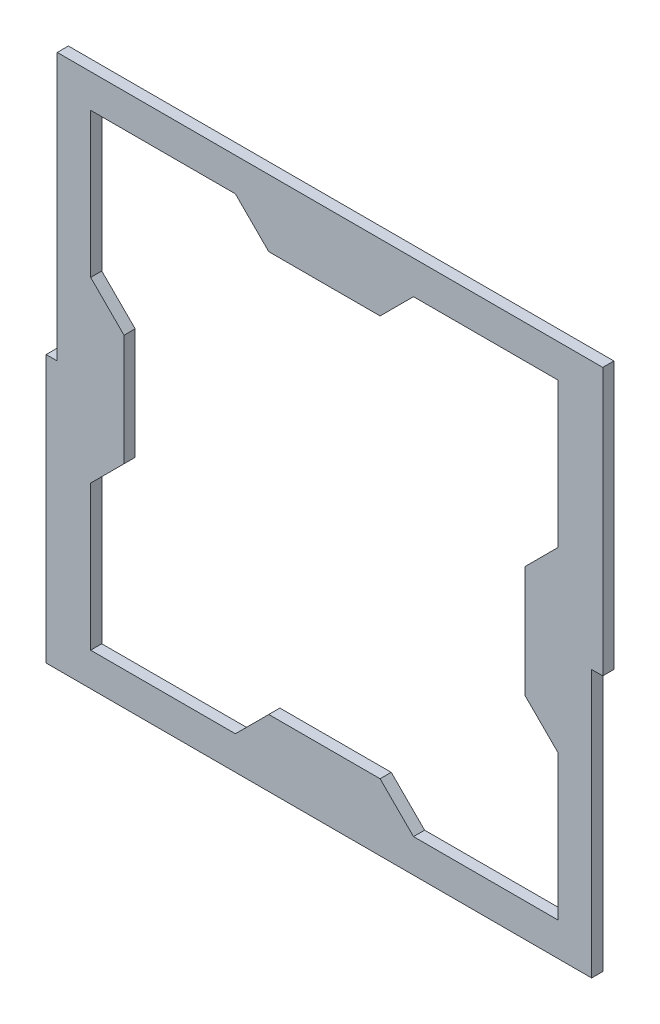
ISO-10303-21;
HEADER;
FILE_DESCRIPTION(('STEP AP214'),'2;1');
FILE_NAME('part.step','',(''),(''),'','','');
FILE_SCHEMA(('AUTOMOTIVE_DESIGN { 1 0 10303 214 1 1 1 1 }'));
ENDSEC;
DATA;
#1=APPLICATION_CONTEXT('core data for automotive mechanical design processes');
#2=APPLICATION_PROTOCOL_DEFINITION('international standard','automotive_design',2000,#1);
#3=PRODUCT_CONTEXT('',#1,'mechanical');
#4=PRODUCT('Part','Part','',(#3));
#5=PRODUCT_RELATED_PRODUCT_CATEGORY('part','',(#4));
#6=PRODUCT_DEFINITION_FORMATION('','',#4);
#7=PRODUCT_DEFINITION_CONTEXT('part definition',#1,'design');
#8=PRODUCT_DEFINITION('design','',#6,#7);
#9=PRODUCT_DEFINITION_SHAPE('','',#8);
#10=(LENGTH_UNIT() NAMED_UNIT(*) SI_UNIT(.MILLI.,.METRE.));
#11=(NAMED_UNIT(*) PLANE_ANGLE_UNIT() SI_UNIT($,.RADIAN.));
#12=(NAMED_UNIT(*) SI_UNIT($,.STERADIAN.) SOLID_ANGLE_UNIT());
#13=UNCERTAINTY_MEASURE_WITH_UNIT(LENGTH_MEASURE(1.E-05),#10,'distance_accuracy_value','');
#14=(GEOMETRIC_REPRESENTATION_CONTEXT(3) GLOBAL_UNCERTAINTY_ASSIGNED_CONTEXT((#13)) GLOBAL_UNIT_ASSIGNED_CONTEXT((#10,
#11,#12)) REPRESENTATION_CONTEXT('',''));
#15=CARTESIAN_POINT('',(0.,0.,0.));
#16=DIRECTION('',(0.,0.,1.));
#17=DIRECTION('',(1.,0.,0.));
#18=AXIS2_PLACEMENT_3D('',#15,#16,#17);
#19=CARTESIAN_POINT('',(-76.2,0.,3.175));
#20=DIRECTION('',(-1.,0.,0.));
#21=DIRECTION('',(0.,0.,1.));
#22=AXIS2_PLACEMENT_3D('',#19,#20,#21);
#23=PLANE('',#22);
#24=DIRECTION('',(0.,1.,0.));
#25=VECTOR('',#24,1.);
#26=CARTESIAN_POINT('',(-76.2,0.,0.));
#27=LINE('',#26,#25);
#28=CARTESIAN_POINT('',(-76.2,0.,0.));
#29=VERTEX_POINT('',#28);
#30=CARTESIAN_POINT('',(-76.2,76.2,0.));
#31=VERTEX_POINT('',#30);
#32=EDGE_CURVE('E273',#29,#31,#27,.T.);
#33=ORIENTED_EDGE('',*,*,#32,.F.);
#34=DIRECTION('',(0.,0.,1.));
#35=VECTOR('',#34,1.);
#36=CARTESIAN_POINT('',(-76.2,0.,0.));
#37=LINE('',#36,#35);
#38=CARTESIAN_POINT('',(-76.2,0.,3.175));
#39=VERTEX_POINT('',#38);
#40=EDGE_CURVE('E249',#29,#39,#37,.T.);
#41=ORIENTED_EDGE('',*,*,#40,.T.);
#42=DIRECTION('',(0.,1.,0.));
#43=VECTOR('',#42,1.);
#44=CARTESIAN_POINT('',(-76.2,0.,3.175));
#45=LINE('',#44,#43);
#46=CARTESIAN_POINT('',(-76.2,76.2,3.175));
#47=VERTEX_POINT('',#46);
#48=EDGE_CURVE('E290',#39,#47,#45,.T.);
#49=ORIENTED_EDGE('',*,*,#48,.T.);
#50=DIRECTION('',(0.,0.,-1.));
#51=VECTOR('',#50,1.);
#52=CARTESIAN_POINT('',(-76.2,76.2,3.175));
#53=LINE('',#52,#51);
#54=EDGE_CURVE('E279',#47,#31,#53,.T.);
#55=ORIENTED_EDGE('',*,*,#54,.T.);
#56=EDGE_LOOP('',(#33,#41,#49,#55));
#57=FACE_BOUND('',#56,.T.);
#58=ADVANCED_FACE('F33',(#57),#23,.T.);
#59=CARTESIAN_POINT('',(0.,-66.675,3.175));
#60=DIRECTION('',(0.,-1.,0.));
#61=DIRECTION('',(0.,0.,-1.));
#62=AXIS2_PLACEMENT_3D('',#59,#60,#61);
#63=PLANE('',#62);
#64=DIRECTION('',(-1.,0.,0.));
#65=VECTOR('',#64,1.);
#66=CARTESIAN_POINT('',(0.,-66.675,0.));
#67=LINE('',#66,#65);
#68=CARTESIAN_POINT('',(66.675,-66.675,0.));
#69=VERTEX_POINT('',#68);
#70=CARTESIAN_POINT('',(25.3999999999994,-66.675,0.));
#71=VERTEX_POINT('',#70);
#72=EDGE_CURVE('E298',#69,#71,#67,.T.);
#73=ORIENTED_EDGE('',*,*,#72,.T.);
#74=DIRECTION('',(0.,0.,-1.));
#75=VECTOR('',#74,1.);
#76=CARTESIAN_POINT('',(25.3999999999994,-66.675,3.175));
#77=LINE('',#76,#75);
#78=CARTESIAN_POINT('',(25.3999999999994,-66.675,3.175));
#79=VERTEX_POINT('',#78);
#80=EDGE_CURVE('E11',#79,#71,#77,.T.);
#81=ORIENTED_EDGE('',*,*,#80,.F.);
#82=DIRECTION('',(-1.,0.,0.));
#83=VECTOR('',#82,1.);
#84=CARTESIAN_POINT('',(0.,-66.675,3.175));
#85=LINE('',#84,#83);
#86=CARTESIAN_POINT('',(66.675,-66.675,3.175));
#87=VERTEX_POINT('',#86);
#88=EDGE_CURVE('E413',#87,#79,#85,.T.);
#89=ORIENTED_EDGE('',*,*,#88,.F.);
#90=DIRECTION('',(0.,0.,-1.));
#91=VECTOR('',#90,1.);
#92=CARTESIAN_POINT('',(66.675,-66.675,3.175));
#93=LINE('',#92,#91);
#94=EDGE_CURVE('E343',#87,#69,#93,.T.);
#95=ORIENTED_EDGE('',*,*,#94,.T.);
#96=EDGE_LOOP('',(#73,#81,#89,#95));
#97=FACE_BOUND('',#96,.T.);
#98=ADVANCED_FACE('F545',(#97),#63,.F.);
#99=CARTESIAN_POINT('',(-20.6375000000001,-20.6374999999999,3.175));
#100=DIRECTION('',(-0.707106781186552,-0.707106781186543,0.));
#101=DIRECTION('',(0.707106781186543,-0.707106781186552,0.));
#102=AXIS2_PLACEMENT_3D('',#99,#100,#101);
#103=PLANE('',#102);
#104=DIRECTION('',(-0.707106781186543,0.707106781186552,0.));
#105=VECTOR('',#104,1.);
#106=CARTESIAN_POINT('',(-20.6375000000001,-20.6374999999999,0.));
#107=LINE('',#106,#105);
#108=CARTESIAN_POINT('',(15.8749999999995,-57.15,0.));
#109=VERTEX_POINT('',#108);
#110=EDGE_CURVE('E301',#71,#109,#107,.T.);
#111=ORIENTED_EDGE('',*,*,#110,.T.);
#112=DIRECTION('',(0.,0.,-1.));
#113=VECTOR('',#112,1.);
#114=CARTESIAN_POINT('',(15.8749999999995,-57.15,3.175));
#115=LINE('',#114,#113);
#116=CARTESIAN_POINT('',(15.8749999999995,-57.15,3.175));
#117=VERTEX_POINT('',#116);
#118=EDGE_CURVE('E41',#117,#109,#115,.T.);
#119=ORIENTED_EDGE('',*,*,#118,.F.);
#120=DIRECTION('',(-0.707106781186543,0.707106781186552,0.));
#121=VECTOR('',#120,1.);
#122=CARTESIAN_POINT('',(-20.6375000000001,-20.6374999999999,3.175));
#123=LINE('',#122,#121);
#124=EDGE_CURVE('E421',#79,#117,#123,.T.);
#125=ORIENTED_EDGE('',*,*,#124,.F.);
#126=ORIENTED_EDGE('',*,*,#80,.T.);
#127=EDGE_LOOP('',(#111,#119,#125,#126));
#128=FACE_BOUND('',#127,.T.);
#129=ADVANCED_FACE('F550',(#128),#103,.F.);
#130=CARTESIAN_POINT('',(0.,-57.15,3.175));
#131=DIRECTION('',(0.,-1.,0.));
#132=DIRECTION('',(0.,0.,-1.));
#133=AXIS2_PLACEMENT_3D('',#130,#131,#132);
#134=PLANE('',#133);
#135=DIRECTION('',(-1.,0.,0.));
#136=VECTOR('',#135,1.);
#137=CARTESIAN_POINT('',(0.,-57.15,0.));
#138=LINE('',#137,#136);
#139=CARTESIAN_POINT('',(-15.8750000000005,-57.15,0.));
#140=VERTEX_POINT('',#139);
#141=EDGE_CURVE('E304',#109,#140,#138,.T.);
#142=ORIENTED_EDGE('',*,*,#141,.T.);
#143=DIRECTION('',(0.,0.,-1.));
#144=VECTOR('',#143,1.);
#145=CARTESIAN_POINT('',(-15.8750000000005,-57.15,3.175));
#146=LINE('',#145,#144);
#147=CARTESIAN_POINT('',(-15.8750000000005,-57.15,3.175));
#148=VERTEX_POINT('',#147);
#149=EDGE_CURVE('E383',#148,#140,#146,.T.);
#150=ORIENTED_EDGE('',*,*,#149,.F.);
#151=DIRECTION('',(-1.,0.,0.));
#152=VECTOR('',#151,1.);
#153=CARTESIAN_POINT('',(0.,-57.15,3.175));
#154=LINE('',#153,#152);
#155=EDGE_CURVE('E393',#117,#148,#154,.T.);
#156=ORIENTED_EDGE('',*,*,#155,.F.);
#157=ORIENTED_EDGE('',*,*,#118,.T.);
#158=EDGE_LOOP('',(#142,#150,#156,#157));
#159=FACE_BOUND('',#158,.T.);
#160=ADVANCED_FACE('F391',(#159),#134,.F.);
#161=CARTESIAN_POINT('',(20.6374999999999,-20.6375000000002,3.175));
#162=DIRECTION('',(0.707106781186542,-0.707106781186553,0.));
#163=DIRECTION('',(0.707106781186553,0.707106781186542,0.));
#164=AXIS2_PLACEMENT_3D('',#161,#162,#163);
#165=PLANE('',#164);
#166=DIRECTION('',(-0.707106781186553,-0.707106781186542,0.));
#167=VECTOR('',#166,1.);
#168=CARTESIAN_POINT('',(20.6374999999999,-20.6375000000002,0.));
#169=LINE('',#168,#167);
#170=CARTESIAN_POINT('',(-25.4000000000006,-66.675,0.));
#171=VERTEX_POINT('',#170);
#172=EDGE_CURVE('E306',#140,#171,#169,.T.);
#173=ORIENTED_EDGE('',*,*,#172,.T.);
#174=DIRECTION('',(0.,0.,-1.));
#175=VECTOR('',#174,1.);
#176=CARTESIAN_POINT('',(-25.4000000000006,-66.675,3.175));
#177=LINE('',#176,#175);
#178=CARTESIAN_POINT('',(-25.4000000000006,-66.675,3.175));
#179=VERTEX_POINT('',#178);
#180=EDGE_CURVE('E380',#179,#171,#177,.T.);
#181=ORIENTED_EDGE('',*,*,#180,.F.);
#182=DIRECTION('',(-0.707106781186553,-0.707106781186542,0.));
#183=VECTOR('',#182,1.);
#184=CARTESIAN_POINT('',(20.6374999999999,-20.6375000000002,3.175));
#185=LINE('',#184,#183);
#186=EDGE_CURVE('E411',#148,#179,#185,.T.);
#187=ORIENTED_EDGE('',*,*,#186,.F.);
#188=ORIENTED_EDGE('',*,*,#149,.T.);
#189=EDGE_LOOP('',(#173,#181,#187,#188));
#190=FACE_BOUND('',#189,.T.);
#191=ADVANCED_FACE('F401',(#190),#165,.F.);
#192=CARTESIAN_POINT('',(-66.675,-66.675,0.));
#193=VERTEX_POINT('',#192);
#194=EDGE_CURVE('E302',#171,#193,#67,.T.);
#195=ORIENTED_EDGE('',*,*,#194,.T.);
#196=DIRECTION('',(0.,0.,-1.));
#197=VECTOR('',#196,1.);
#198=CARTESIAN_POINT('',(-66.675,-66.675,3.175));
#199=LINE('',#198,#197);
#200=CARTESIAN_POINT('',(-66.675,-66.675,3.175));
#201=VERTEX_POINT('',#200);
#202=EDGE_CURVE('E377',#201,#193,#199,.T.);
#203=ORIENTED_EDGE('',*,*,#202,.F.);
#204=EDGE_CURVE('E407',#179,#201,#85,.T.);
#205=ORIENTED_EDGE('',*,*,#204,.F.);
#206=ORIENTED_EDGE('',*,*,#180,.T.);
#207=EDGE_LOOP('',(#195,#203,#205,#206));
#208=FACE_BOUND('',#207,.T.);
#209=ADVANCED_FACE('F405',(#208),#63,.F.);
#210=CARTESIAN_POINT('',(-66.675,0.,3.175));
#211=DIRECTION('',(-1.,0.,0.));
#212=DIRECTION('',(0.,0.,1.));
#213=AXIS2_PLACEMENT_3D('',#210,#211,#212);
#214=PLANE('',#213);
#215=DIRECTION('',(0.,1.,0.));
#216=VECTOR('',#215,1.);
#217=CARTESIAN_POINT('',(-66.675,0.,0.));
#218=LINE('',#217,#216);
#219=CARTESIAN_POINT('',(-66.675,-25.3999999999991,0.));
#220=VERTEX_POINT('',#219);
#221=EDGE_CURVE('E308',#193,#220,#218,.T.);
#222=ORIENTED_EDGE('',*,*,#221,.T.);
#223=DIRECTION('',(0.,0.,-1.));
#224=VECTOR('',#223,1.);
#225=CARTESIAN_POINT('',(-66.675,-25.3999999999991,3.175));
#226=LINE('',#225,#224);
#227=CARTESIAN_POINT('',(-66.675,-25.3999999999991,3.175));
#228=VERTEX_POINT('',#227);
#229=EDGE_CURVE('E374',#228,#220,#226,.T.);
#230=ORIENTED_EDGE('',*,*,#229,.F.);
#231=DIRECTION('',(0.,1.,0.));
#232=VECTOR('',#231,1.);
#233=CARTESIAN_POINT('',(-66.675,0.,3.175));
#234=LINE('',#233,#232);
#235=EDGE_CURVE('E410',#201,#228,#234,.T.);
#236=ORIENTED_EDGE('',*,*,#235,.F.);
#237=ORIENTED_EDGE('',*,*,#202,.T.);
#238=EDGE_LOOP('',(#222,#230,#236,#237));
#239=FACE_BOUND('',#238,.T.);
#240=ADVANCED_FACE('F560',(#239),#214,.F.);
#241=CARTESIAN_POINT('',(-20.6374999999998,20.6375000000002,3.175));
#242=DIRECTION('',(-0.707106781186541,0.707106781186554,0.));
#243=DIRECTION('',(-0.707106781186554,-0.707106781186541,0.));
#244=AXIS2_PLACEMENT_3D('',#241,#242,#243);
#245=PLANE('',#244);
#246=DIRECTION('',(0.707106781186554,0.707106781186541,0.));
#247=VECTOR('',#246,1.);
#248=CARTESIAN_POINT('',(-20.6374999999998,20.6375000000002,0.));
#249=LINE('',#248,#247);
#250=CARTESIAN_POINT('',(-57.15,-15.8749999999993,0.));
#251=VERTEX_POINT('',#250);
#252=EDGE_CURVE('E310',#220,#251,#249,.T.);
#253=ORIENTED_EDGE('',*,*,#252,.T.);
#254=DIRECTION('',(0.,0.,-1.));
#255=VECTOR('',#254,1.);
#256=CARTESIAN_POINT('',(-57.15,-15.8749999999993,3.175));
#257=LINE('',#256,#255);
#258=CARTESIAN_POINT('',(-57.15,-15.8749999999993,3.175));
#259=VERTEX_POINT('',#258);
#260=EDGE_CURVE('E371',#259,#251,#257,.T.);
#261=ORIENTED_EDGE('',*,*,#260,.F.);
#262=DIRECTION('',(0.707106781186554,0.707106781186541,0.));
#263=VECTOR('',#262,1.);
#264=CARTESIAN_POINT('',(-20.6374999999998,20.6375000000002,3.175));
#265=LINE('',#264,#263);
#266=EDGE_CURVE('E414',#228,#259,#265,.T.);
#267=ORIENTED_EDGE('',*,*,#266,.F.);
#268=ORIENTED_EDGE('',*,*,#229,.T.);
#269=EDGE_LOOP('',(#253,#261,#267,#268));
#270=FACE_BOUND('',#269,.T.);
#271=ADVANCED_FACE('F565',(#270),#245,.F.);
#272=CARTESIAN_POINT('',(-57.15,0.,3.175));
#273=DIRECTION('',(-1.,0.,0.));
#274=DIRECTION('',(0.,0.,1.));
#275=AXIS2_PLACEMENT_3D('',#272,#273,#274);
#276=PLANE('',#275);
#277=DIRECTION('',(0.,1.,0.));
#278=VECTOR('',#277,1.);
#279=CARTESIAN_POINT('',(-57.15,0.,0.));
#280=LINE('',#279,#278);
#281=CARTESIAN_POINT('',(-57.15,15.8750000000008,0.));
#282=VERTEX_POINT('',#281);
#283=EDGE_CURVE('E313',#251,#282,#280,.T.);
#284=ORIENTED_EDGE('',*,*,#283,.T.);
#285=DIRECTION('',(0.,0.,-1.));
#286=VECTOR('',#285,1.);
#287=CARTESIAN_POINT('',(-57.15,15.8750000000008,3.175));
#288=LINE('',#287,#286);
#289=CARTESIAN_POINT('',(-57.15,15.8750000000008,3.175));
#290=VERTEX_POINT('',#289);
#291=EDGE_CURVE('E368',#290,#282,#288,.T.);
#292=ORIENTED_EDGE('',*,*,#291,.F.);
#293=DIRECTION('',(0.,1.,0.));
#294=VECTOR('',#293,1.);
#295=CARTESIAN_POINT('',(-57.15,0.,3.175));
#296=LINE('',#295,#294);
#297=EDGE_CURVE('E467',#259,#290,#296,.T.);
#298=ORIENTED_EDGE('',*,*,#297,.F.);
#299=ORIENTED_EDGE('',*,*,#260,.T.);
#300=EDGE_LOOP('',(#284,#292,#298,#299));
#301=FACE_BOUND('',#300,.T.);
#302=ADVANCED_FACE('F479',(#301),#276,.F.);
#303=CARTESIAN_POINT('',(-20.6375000000002,-20.6374999999998,3.175));
#304=DIRECTION('',(-0.707106781186555,-0.70710678118654,0.));
#305=DIRECTION('',(0.70710678118654,-0.707106781186555,0.));
#306=AXIS2_PLACEMENT_3D('',#303,#304,#305);
#307=PLANE('',#306);
#308=DIRECTION('',(-0.70710678118654,0.707106781186555,0.));
#309=VECTOR('',#308,1.);
#310=CARTESIAN_POINT('',(-20.6375000000002,-20.6374999999998,0.));
#311=LINE('',#310,#309);
#312=CARTESIAN_POINT('',(-66.675,25.400000000001,0.));
#313=VERTEX_POINT('',#312);
#314=EDGE_CURVE('E315',#282,#313,#311,.T.);
#315=ORIENTED_EDGE('',*,*,#314,.T.);
#316=DIRECTION('',(0.,0.,-1.));
#317=VECTOR('',#316,1.);
#318=CARTESIAN_POINT('',(-66.675,25.400000000001,3.175));
#319=LINE('',#318,#317);
#320=CARTESIAN_POINT('',(-66.675,25.400000000001,3.175));
#321=VERTEX_POINT('',#320);
#322=EDGE_CURVE('E365',#321,#313,#319,.T.);
#323=ORIENTED_EDGE('',*,*,#322,.F.);
#324=DIRECTION('',(-0.70710678118654,0.707106781186555,0.));
#325=VECTOR('',#324,1.);
#326=CARTESIAN_POINT('',(-20.6375000000002,-20.6374999999998,3.175));
#327=LINE('',#326,#325);
#328=EDGE_CURVE('E464',#290,#321,#327,.T.);
#329=ORIENTED_EDGE('',*,*,#328,.F.);
#330=ORIENTED_EDGE('',*,*,#291,.T.);
#331=EDGE_LOOP('',(#315,#323,#329,#330));
#332=FACE_BOUND('',#331,.T.);
#333=ADVANCED_FACE('F483',(#332),#307,.F.);
#334=CARTESIAN_POINT('',(-66.675,66.675,0.));
#335=VERTEX_POINT('',#334);
#336=EDGE_CURVE('E311',#313,#335,#218,.T.);
#337=ORIENTED_EDGE('',*,*,#336,.T.);
#338=DIRECTION('',(0.,0.,-1.));
#339=VECTOR('',#338,1.);
#340=CARTESIAN_POINT('',(-66.675,66.675,3.175));
#341=LINE('',#340,#339);
#342=CARTESIAN_POINT('',(-66.675,66.675,3.175));
#343=VERTEX_POINT('',#342);
#344=EDGE_CURVE('E363',#343,#335,#341,.T.);
#345=ORIENTED_EDGE('',*,*,#344,.F.);
#346=EDGE_CURVE('E416',#321,#343,#234,.T.);
#347=ORIENTED_EDGE('',*,*,#346,.F.);
#348=ORIENTED_EDGE('',*,*,#322,.T.);
#349=EDGE_LOOP('',(#337,#345,#347,#348));
#350=FACE_BOUND('',#349,.T.);
#351=ADVANCED_FACE('F487',(#350),#214,.F.);
#352=CARTESIAN_POINT('',(0.,66.675,3.175));
#353=DIRECTION('',(0.,-1.,0.));
#354=DIRECTION('',(0.,0.,-1.));
#355=AXIS2_PLACEMENT_3D('',#352,#353,#354);
#356=PLANE('',#355);
#357=DIRECTION('',(-1.,0.,0.));
#358=VECTOR('',#357,1.);
#359=CARTESIAN_POINT('',(0.,66.675,0.));
#360=LINE('',#359,#358);
#361=CARTESIAN_POINT('',(-25.4,66.675,0.));
#362=VERTEX_POINT('',#361);
#363=EDGE_CURVE('E317',#362,#335,#360,.T.);
#364=ORIENTED_EDGE('',*,*,#363,.F.);
#365=DIRECTION('',(0.,0.,-1.));
#366=VECTOR('',#365,1.);
#367=CARTESIAN_POINT('',(-25.4,66.675,3.175));
#368=LINE('',#367,#366);
#369=CARTESIAN_POINT('',(-25.4,66.675,3.175));
#370=VERTEX_POINT('',#369);
#371=EDGE_CURVE('E361',#370,#362,#368,.T.);
#372=ORIENTED_EDGE('',*,*,#371,.F.);
#373=DIRECTION('',(-1.,0.,0.));
#374=VECTOR('',#373,1.);
#375=CARTESIAN_POINT('',(0.,66.675,3.175));
#376=LINE('',#375,#374);
#377=EDGE_CURVE('E454',#370,#343,#376,.T.);
#378=ORIENTED_EDGE('',*,*,#377,.T.);
#379=ORIENTED_EDGE('',*,*,#344,.T.);
#380=EDGE_LOOP('',(#364,#372,#378,#379));
#381=FACE_BOUND('',#380,.T.);
#382=ADVANCED_FACE('F489',(#381),#356,.T.);
#383=CARTESIAN_POINT('',(20.6375,20.6375,3.175));
#384=DIRECTION('',(0.707106781186547,0.707106781186548,0.));
#385=DIRECTION('',(-0.707106781186548,0.707106781186547,0.));
#386=AXIS2_PLACEMENT_3D('',#383,#384,#385);
#387=PLANE('',#386);
#388=DIRECTION('',(0.707106781186548,-0.707106781186547,0.));
#389=VECTOR('',#388,1.);
#390=CARTESIAN_POINT('',(20.6375,20.6375,0.));
#391=LINE('',#390,#389);
#392=CARTESIAN_POINT('',(-15.875,57.15,0.));
#393=VERTEX_POINT('',#392);
#394=EDGE_CURVE('E320',#362,#393,#391,.T.);
#395=ORIENTED_EDGE('',*,*,#394,.T.);
#396=DIRECTION('',(0.,0.,-1.));
#397=VECTOR('',#396,1.);
#398=CARTESIAN_POINT('',(-15.875,57.15,3.175));
#399=LINE('',#398,#397);
#400=CARTESIAN_POINT('',(-15.875,57.15,3.175));
#401=VERTEX_POINT('',#400);
#402=EDGE_CURVE('E359',#401,#393,#399,.T.);
#403=ORIENTED_EDGE('',*,*,#402,.F.);
#404=DIRECTION('',(0.707106781186548,-0.707106781186547,0.));
#405=VECTOR('',#404,1.);
#406=CARTESIAN_POINT('',(20.6375,20.6375,3.175));
#407=LINE('',#406,#405);
#408=EDGE_CURVE('E461',#370,#401,#407,.T.);
#409=ORIENTED_EDGE('',*,*,#408,.F.);
#410=ORIENTED_EDGE('',*,*,#371,.T.);
#411=EDGE_LOOP('',(#395,#403,#409,#410));
#412=FACE_BOUND('',#411,.T.);
#413=ADVANCED_FACE('F496',(#412),#387,.F.);
#414=CARTESIAN_POINT('',(0.,57.15,3.175));
#415=DIRECTION('',(0.,-1.,0.));
#416=DIRECTION('',(0.,0.,-1.));
#417=AXIS2_PLACEMENT_3D('',#414,#415,#416);
#418=PLANE('',#417);
#419=DIRECTION('',(-1.,0.,0.));
#420=VECTOR('',#419,1.);
#421=CARTESIAN_POINT('',(0.,57.15,0.));
#422=LINE('',#421,#420);
#423=CARTESIAN_POINT('',(15.875,57.15,0.));
#424=VERTEX_POINT('',#423);
#425=EDGE_CURVE('E324',#424,#393,#422,.T.);
#426=ORIENTED_EDGE('',*,*,#425,.F.);
#427=DIRECTION('',(0.,0.,-1.));
#428=VECTOR('',#427,1.);
#429=CARTESIAN_POINT('',(15.875,57.15,3.175));
#430=LINE('',#429,#428);
#431=CARTESIAN_POINT('',(15.875,57.15,3.175));
#432=VERTEX_POINT('',#431);
#433=EDGE_CURVE('E357',#432,#424,#430,.T.);
#434=ORIENTED_EDGE('',*,*,#433,.F.);
#435=DIRECTION('',(-1.,0.,0.));
#436=VECTOR('',#435,1.);
#437=CARTESIAN_POINT('',(0.,57.15,3.175));
#438=LINE('',#437,#436);
#439=EDGE_CURVE('E457',#432,#401,#438,.T.);
#440=ORIENTED_EDGE('',*,*,#439,.T.);
#441=ORIENTED_EDGE('',*,*,#402,.T.);
#442=EDGE_LOOP('',(#426,#434,#440,#441));
#443=FACE_BOUND('',#442,.T.);
#444=ADVANCED_FACE('F503',(#443),#418,.T.);
#445=CARTESIAN_POINT('',(-20.6375,20.6375,3.175));
#446=DIRECTION('',(-0.707106781186548,0.707106781186548,0.));
#447=DIRECTION('',(-0.707106781186548,-0.707106781186548,0.));
#448=AXIS2_PLACEMENT_3D('',#445,#446,#447);
#449=PLANE('',#448);
#450=DIRECTION('',(0.707106781186548,0.707106781186548,0.));
#451=VECTOR('',#450,1.);
#452=CARTESIAN_POINT('',(-20.6375,20.6375,0.));
#453=LINE('',#452,#451);
#454=CARTESIAN_POINT('',(25.4,66.675,0.));
#455=VERTEX_POINT('',#454);
#456=EDGE_CURVE('E327',#424,#455,#453,.T.);
#457=ORIENTED_EDGE('',*,*,#456,.T.);
#458=DIRECTION('',(0.,0.,-1.));
#459=VECTOR('',#458,1.);
#460=CARTESIAN_POINT('',(25.4,66.675,3.175));
#461=LINE('',#460,#459);
#462=CARTESIAN_POINT('',(25.4,66.675,3.175));
#463=VERTEX_POINT('',#462);
#464=EDGE_CURVE('E355',#463,#455,#461,.T.);
#465=ORIENTED_EDGE('',*,*,#464,.F.);
#466=DIRECTION('',(0.707106781186548,0.707106781186548,0.));
#467=VECTOR('',#466,1.);
#468=CARTESIAN_POINT('',(-20.6375,20.6375,3.175));
#469=LINE('',#468,#467);
#470=EDGE_CURVE('E452',#432,#463,#469,.T.);
#471=ORIENTED_EDGE('',*,*,#470,.F.);
#472=ORIENTED_EDGE('',*,*,#433,.T.);
#473=EDGE_LOOP('',(#457,#465,#471,#472));
#474=FACE_BOUND('',#473,.T.);
#475=ADVANCED_FACE('F505',(#474),#449,.F.);
#476=CARTESIAN_POINT('',(66.675,66.675,0.));
#477=VERTEX_POINT('',#476);
#478=EDGE_CURVE('E321',#477,#455,#360,.T.);
#479=ORIENTED_EDGE('',*,*,#478,.F.);
#480=DIRECTION('',(0.,0.,-1.));
#481=VECTOR('',#480,1.);
#482=CARTESIAN_POINT('',(66.675,66.675,3.175));
#483=LINE('',#482,#481);
#484=CARTESIAN_POINT('',(66.675,66.675,3.175));
#485=VERTEX_POINT('',#484);
#486=EDGE_CURVE('E353',#485,#477,#483,.T.);
#487=ORIENTED_EDGE('',*,*,#486,.F.);
#488=EDGE_CURVE('E448',#485,#463,#376,.T.);
#489=ORIENTED_EDGE('',*,*,#488,.T.);
#490=ORIENTED_EDGE('',*,*,#464,.T.);
#491=EDGE_LOOP('',(#479,#487,#489,#490));
#492=FACE_BOUND('',#491,.T.);
#493=ADVANCED_FACE('F508',(#492),#356,.T.);
#494=CARTESIAN_POINT('',(66.675,0.,3.175));
#495=DIRECTION('',(-1.,0.,0.));
#496=DIRECTION('',(0.,0.,1.));
#497=AXIS2_PLACEMENT_3D('',#494,#495,#496);
#498=PLANE('',#497);
#499=DIRECTION('',(0.,1.,0.));
#500=VECTOR('',#499,1.);
#501=CARTESIAN_POINT('',(66.675,0.,0.));
#502=LINE('',#501,#500);
#503=CARTESIAN_POINT('',(66.675,25.3999999999997,0.));
#504=VERTEX_POINT('',#503);
#505=EDGE_CURVE('E330',#504,#477,#502,.T.);
#506=ORIENTED_EDGE('',*,*,#505,.F.);
#507=DIRECTION('',(0.,0.,-1.));
#508=VECTOR('',#507,1.);
#509=CARTESIAN_POINT('',(66.675,25.3999999999997,3.175));
#510=LINE('',#509,#508);
#511=CARTESIAN_POINT('',(66.675,25.3999999999997,3.175));
#512=VERTEX_POINT('',#511);
#513=EDGE_CURVE('E351',#512,#504,#510,.T.);
#514=ORIENTED_EDGE('',*,*,#513,.F.);
#515=DIRECTION('',(0.,1.,0.));
#516=VECTOR('',#515,1.);
#517=CARTESIAN_POINT('',(66.675,0.,3.175));
#518=LINE('',#517,#516);
#519=EDGE_CURVE('E441',#512,#485,#518,.T.);
#520=ORIENTED_EDGE('',*,*,#519,.T.);
#521=ORIENTED_EDGE('',*,*,#486,.T.);
#522=EDGE_LOOP('',(#506,#514,#520,#521));
#523=FACE_BOUND('',#522,.T.);
#524=ADVANCED_FACE('F511',(#523),#498,.T.);
#525=CARTESIAN_POINT('',(20.6375,-20.6375000000001,3.175));
#526=DIRECTION('',(0.707106781186546,-0.707106781186549,0.));
#527=DIRECTION('',(0.707106781186549,0.707106781186546,0.));
#528=AXIS2_PLACEMENT_3D('',#525,#526,#527);
#529=PLANE('',#528);
#530=DIRECTION('',(-0.707106781186549,-0.707106781186546,0.));
#531=VECTOR('',#530,1.);
#532=CARTESIAN_POINT('',(20.6375,-20.6375000000001,0.));
#533=LINE('',#532,#531);
#534=CARTESIAN_POINT('',(57.15,15.8749999999997,0.));
#535=VERTEX_POINT('',#534);
#536=EDGE_CURVE('E333',#504,#535,#533,.T.);
#537=ORIENTED_EDGE('',*,*,#536,.T.);
#538=DIRECTION('',(0.,0.,-1.));
#539=VECTOR('',#538,1.);
#540=CARTESIAN_POINT('',(57.15,15.8749999999997,3.175));
#541=LINE('',#540,#539);
#542=CARTESIAN_POINT('',(57.15,15.8749999999997,3.175));
#543=VERTEX_POINT('',#542);
#544=EDGE_CURVE('E349',#543,#535,#541,.T.);
#545=ORIENTED_EDGE('',*,*,#544,.F.);
#546=DIRECTION('',(-0.707106781186549,-0.707106781186546,0.));
#547=VECTOR('',#546,1.);
#548=CARTESIAN_POINT('',(20.6375,-20.6375000000001,3.175));
#549=LINE('',#548,#547);
#550=EDGE_CURVE('E447',#512,#543,#549,.T.);
#551=ORIENTED_EDGE('',*,*,#550,.F.);
#552=ORIENTED_EDGE('',*,*,#513,.T.);
#553=EDGE_LOOP('',(#537,#545,#551,#552));
#554=FACE_BOUND('',#553,.T.);
#555=ADVANCED_FACE('F515',(#554),#529,.F.);
#556=CARTESIAN_POINT('',(57.15,0.,3.175));
#557=DIRECTION('',(-1.,0.,0.));
#558=DIRECTION('',(0.,-1.,0.));
#559=AXIS2_PLACEMENT_3D('',#556,#557,#558);
#560=PLANE('',#559);
#561=DIRECTION('',(0.,1.,0.));
#562=VECTOR('',#561,1.);
#563=CARTESIAN_POINT('',(57.15,0.,0.));
#564=LINE('',#563,#562);
#565=CARTESIAN_POINT('',(57.15,-15.8750000000002,0.));
#566=VERTEX_POINT('',#565);
#567=EDGE_CURVE('E337',#566,#535,#564,.T.);
#568=ORIENTED_EDGE('',*,*,#567,.F.);
#569=DIRECTION('',(0.,0.,-1.));
#570=VECTOR('',#569,1.);
#571=CARTESIAN_POINT('',(57.15,-15.8750000000002,3.175));
#572=LINE('',#571,#570);
#573=CARTESIAN_POINT('',(57.15,-15.8750000000002,3.175));
#574=VERTEX_POINT('',#573);
#575=EDGE_CURVE('E347',#574,#566,#572,.T.);
#576=ORIENTED_EDGE('',*,*,#575,.F.);
#577=DIRECTION('',(0.,1.,0.));
#578=VECTOR('',#577,1.);
#579=CARTESIAN_POINT('',(57.15,0.,3.175));
#580=LINE('',#579,#578);
#581=EDGE_CURVE('E443',#574,#543,#580,.T.);
#582=ORIENTED_EDGE('',*,*,#581,.T.);
#583=ORIENTED_EDGE('',*,*,#544,.T.);
#584=EDGE_LOOP('',(#568,#576,#582,#583));
#585=FACE_BOUND('',#584,.T.);
#586=ADVANCED_FACE('F522',(#585),#560,.T.);
#587=CARTESIAN_POINT('',(20.6375000000001,20.6374999999999,3.175));
#588=DIRECTION('',(0.70710678118655,0.707106781186545,0.));
#589=DIRECTION('',(-0.707106781186545,0.70710678118655,0.));
#590=AXIS2_PLACEMENT_3D('',#587,#588,#589);
#591=PLANE('',#590);
#592=DIRECTION('',(0.707106781186545,-0.70710678118655,0.));
#593=VECTOR('',#592,1.);
#594=CARTESIAN_POINT('',(20.6375000000001,20.6374999999999,0.));
#595=LINE('',#594,#593);
#596=CARTESIAN_POINT('',(66.675,-25.4000000000003,0.));
#597=VERTEX_POINT('',#596);
#598=EDGE_CURVE('E340',#566,#597,#595,.T.);
#599=ORIENTED_EDGE('',*,*,#598,.T.);
#600=DIRECTION('',(0.,0.,-1.));
#601=VECTOR('',#600,1.);
#602=CARTESIAN_POINT('',(66.675,-25.4000000000003,3.175));
#603=LINE('',#602,#601);
#604=CARTESIAN_POINT('',(66.675,-25.4000000000003,3.175));
#605=VERTEX_POINT('',#604);
#606=EDGE_CURVE('E345',#605,#597,#603,.T.);
#607=ORIENTED_EDGE('',*,*,#606,.F.);
#608=DIRECTION('',(0.707106781186545,-0.70710678118655,0.));
#609=VECTOR('',#608,1.);
#610=CARTESIAN_POINT('',(20.6375000000001,20.6374999999999,3.175));
#611=LINE('',#610,#609);
#612=EDGE_CURVE('E294',#574,#605,#611,.T.);
#613=ORIENTED_EDGE('',*,*,#612,.F.);
#614=ORIENTED_EDGE('',*,*,#575,.T.);
#615=EDGE_LOOP('',(#599,#607,#613,#614));
#616=FACE_BOUND('',#615,.T.);
#617=ADVANCED_FACE('F525',(#616),#591,.F.);
#618=CARTESIAN_POINT('',(0.,-76.2,3.175));
#619=DIRECTION('',(0.,-1.,0.));
#620=DIRECTION('',(0.,0.,-1.));
#621=AXIS2_PLACEMENT_3D('',#618,#619,#620);
#622=PLANE('',#621);
#623=DIRECTION('',(0.,0.,1.));
#624=VECTOR('',#623,1.);
#625=CARTESIAN_POINT('',(76.2,-76.2,0.));
#626=LINE('',#625,#624);
#627=CARTESIAN_POINT('',(76.2,-76.2,0.));
#628=VERTEX_POINT('',#627);
#629=CARTESIAN_POINT('',(76.2,-76.2,3.175));
#630=VERTEX_POINT('',#629);
#631=EDGE_CURVE('E224',#628,#630,#626,.T.);
#632=ORIENTED_EDGE('',*,*,#631,.T.);
#633=DIRECTION('',(-1.,0.,0.));
#634=VECTOR('',#633,1.);
#635=CARTESIAN_POINT('',(0.,-76.2,3.175));
#636=LINE('',#635,#634);
#637=CARTESIAN_POINT('',(-79.375,-76.2,3.175));
#638=VERTEX_POINT('',#637);
#639=EDGE_CURVE('E427',#630,#638,#636,.T.);
#640=ORIENTED_EDGE('',*,*,#639,.T.);
#641=DIRECTION('',(0.,0.,1.));
#642=VECTOR('',#641,1.);
#643=CARTESIAN_POINT('',(-79.375,-76.2,0.));
#644=LINE('',#643,#642);
#645=CARTESIAN_POINT('',(-79.375,-76.2,0.));
#646=VERTEX_POINT('',#645);
#647=EDGE_CURVE('E254',#646,#638,#644,.T.);
#648=ORIENTED_EDGE('',*,*,#647,.F.);
#649=DIRECTION('',(-1.,0.,0.));
#650=VECTOR('',#649,1.);
#651=CARTESIAN_POINT('',(0.,-76.2,0.));
#652=LINE('',#651,#650);
#653=EDGE_CURVE('E280',#628,#646,#652,.T.);
#654=ORIENTED_EDGE('',*,*,#653,.F.);
#655=EDGE_LOOP('',(#632,#640,#648,#654));
#656=FACE_BOUND('',#655,.T.);
#657=ADVANCED_FACE('F534',(#656),#622,.T.);
#658=CARTESIAN_POINT('',(0.,76.2,3.175));
#659=DIRECTION('',(0.,-1.,0.));
#660=DIRECTION('',(1.,0.,0.));
#661=AXIS2_PLACEMENT_3D('',#658,#659,#660);
#662=PLANE('',#661);
#663=ORIENTED_EDGE('',*,*,#54,.F.);
#664=DIRECTION('',(-1.,0.,0.));
#665=VECTOR('',#664,1.);
#666=CARTESIAN_POINT('',(0.,76.2,3.175));
#667=LINE('',#666,#665);
#668=CARTESIAN_POINT('',(79.375,76.2,3.175));
#669=VERTEX_POINT('',#668);
#670=EDGE_CURVE('E422',#669,#47,#667,.T.);
#671=ORIENTED_EDGE('',*,*,#670,.F.);
#672=DIRECTION('',(0.,0.,1.));
#673=VECTOR('',#672,1.);
#674=CARTESIAN_POINT('',(79.375,76.2,0.));
#675=LINE('',#674,#673);
#676=CARTESIAN_POINT('',(79.375,76.2,0.));
#677=VERTEX_POINT('',#676);
#678=EDGE_CURVE('E281',#677,#669,#675,.T.);
#679=ORIENTED_EDGE('',*,*,#678,.F.);
#680=DIRECTION('',(-1.,0.,0.));
#681=VECTOR('',#680,1.);
#682=CARTESIAN_POINT('',(0.,76.2,0.));
#683=LINE('',#682,#681);
#684=EDGE_CURVE('E283',#677,#31,#683,.T.);
#685=ORIENTED_EDGE('',*,*,#684,.T.);
#686=EDGE_LOOP('',(#663,#671,#679,#685));
#687=FACE_BOUND('',#686,.T.);
#688=ADVANCED_FACE('F437',(#687),#662,.F.);
#689=EDGE_CURVE('E334',#69,#597,#502,.T.);
#690=ORIENTED_EDGE('',*,*,#689,.F.);
#691=ORIENTED_EDGE('',*,*,#94,.F.);
#692=EDGE_CURVE('E438',#87,#605,#518,.T.);
#693=ORIENTED_EDGE('',*,*,#692,.T.);
#694=ORIENTED_EDGE('',*,*,#606,.T.);
#695=EDGE_LOOP('',(#690,#691,#693,#694));
#696=FACE_BOUND('',#695,.T.);
#697=ADVANCED_FACE('F528',(#696),#498,.T.);
#698=CARTESIAN_POINT('',(0.,0.,3.175));
#699=DIRECTION('',(0.,0.,1.));
#700=DIRECTION('',(1.,0.,0.));
#701=AXIS2_PLACEMENT_3D('',#698,#699,#700);
#702=PLANE('',#701);
#703=DIRECTION('',(0.,-1.,0.));
#704=VECTOR('',#703,1.);
#705=CARTESIAN_POINT('',(76.2,0.,3.175));
#706=LINE('',#705,#704);
#707=CARTESIAN_POINT('',(76.2,0.,3.175));
#708=VERTEX_POINT('',#707);
#709=EDGE_CURVE('E239',#708,#630,#706,.T.);
#710=ORIENTED_EDGE('',*,*,#709,.F.);
#711=DIRECTION('',(-1.,0.,0.));
#712=VECTOR('',#711,1.);
#713=CARTESIAN_POINT('',(79.375,0.,3.175));
#714=LINE('',#713,#712);
#715=CARTESIAN_POINT('',(79.375,0.,3.175));
#716=VERTEX_POINT('',#715);
#717=EDGE_CURVE('E221',#716,#708,#714,.T.);
#718=ORIENTED_EDGE('',*,*,#717,.F.);
#719=DIRECTION('',(0.,1.,0.));
#720=VECTOR('',#719,1.);
#721=CARTESIAN_POINT('',(79.375,-76.2,3.175));
#722=LINE('',#721,#720);
#723=EDGE_CURVE('E257',#716,#669,#722,.T.);
#724=ORIENTED_EDGE('',*,*,#723,.T.);
#725=ORIENTED_EDGE('',*,*,#670,.T.);
#726=ORIENTED_EDGE('',*,*,#48,.F.);
#727=DIRECTION('',(-1.,0.,0.));
#728=VECTOR('',#727,1.);
#729=CARTESIAN_POINT('',(-76.2,0.,3.175));
#730=LINE('',#729,#728);
#731=CARTESIAN_POINT('',(-79.375,0.,3.175));
#732=VERTEX_POINT('',#731);
#733=EDGE_CURVE('E57',#39,#732,#730,.T.);
#734=ORIENTED_EDGE('',*,*,#733,.T.);
#735=DIRECTION('',(0.,-1.,0.));
#736=VECTOR('',#735,1.);
#737=CARTESIAN_POINT('',(-79.375,-76.2,3.175));
#738=LINE('',#737,#736);
#739=EDGE_CURVE('E251',#732,#638,#738,.T.);
#740=ORIENTED_EDGE('',*,*,#739,.T.);
#741=ORIENTED_EDGE('',*,*,#639,.F.);
#742=EDGE_LOOP('',(#710,#718,#724,#725,#726,#734,#740,#741));
#743=FACE_BOUND('',#742,.T.);
#744=ORIENTED_EDGE('',*,*,#88,.T.);
#745=ORIENTED_EDGE('',*,*,#124,.T.);
#746=ORIENTED_EDGE('',*,*,#155,.T.);
#747=ORIENTED_EDGE('',*,*,#186,.T.);
#748=ORIENTED_EDGE('',*,*,#204,.T.);
#749=ORIENTED_EDGE('',*,*,#235,.T.);
#750=ORIENTED_EDGE('',*,*,#266,.T.);
#751=ORIENTED_EDGE('',*,*,#297,.T.);
#752=ORIENTED_EDGE('',*,*,#328,.T.);
#753=ORIENTED_EDGE('',*,*,#346,.T.);
#754=ORIENTED_EDGE('',*,*,#377,.F.);
#755=ORIENTED_EDGE('',*,*,#408,.T.);
#756=ORIENTED_EDGE('',*,*,#439,.F.);
#757=ORIENTED_EDGE('',*,*,#470,.T.);
#758=ORIENTED_EDGE('',*,*,#488,.F.);
#759=ORIENTED_EDGE('',*,*,#519,.F.);
#760=ORIENTED_EDGE('',*,*,#550,.T.);
#761=ORIENTED_EDGE('',*,*,#581,.F.);
#762=ORIENTED_EDGE('',*,*,#612,.T.);
#763=ORIENTED_EDGE('',*,*,#692,.F.);
#764=EDGE_LOOP('',(#744,#745,#746,#747,#748,#749,#750,#751,#752,#753,#754,#755,#756,#757,#758,
#759,#760,#761,#762,#763));
#765=FACE_BOUND('',#764,.T.);
#766=ADVANCED_FACE('F473',(#743,#765),#702,.T.);
#767=CARTESIAN_POINT('',(0.,0.,0.));
#768=DIRECTION('',(0.,0.,1.));
#769=DIRECTION('',(1.,0.,0.));
#770=AXIS2_PLACEMENT_3D('',#767,#768,#769);
#771=PLANE('',#770);
#772=DIRECTION('',(-1.,0.,0.));
#773=VECTOR('',#772,1.);
#774=CARTESIAN_POINT('',(79.375,0.,0.));
#775=LINE('',#774,#773);
#776=CARTESIAN_POINT('',(79.375,0.,0.));
#777=VERTEX_POINT('',#776);
#778=CARTESIAN_POINT('',(76.2,0.,0.));
#779=VERTEX_POINT('',#778);
#780=EDGE_CURVE('E49',#777,#779,#775,.T.);
#781=ORIENTED_EDGE('',*,*,#780,.T.);
#782=DIRECTION('',(0.,-1.,0.));
#783=VECTOR('',#782,1.);
#784=CARTESIAN_POINT('',(76.2,0.,0.));
#785=LINE('',#784,#783);
#786=EDGE_CURVE('E228',#779,#628,#785,.T.);
#787=ORIENTED_EDGE('',*,*,#786,.T.);
#788=ORIENTED_EDGE('',*,*,#653,.T.);
#789=DIRECTION('',(0.,-1.,0.));
#790=VECTOR('',#789,1.);
#791=CARTESIAN_POINT('',(-79.375,-76.2,0.));
#792=LINE('',#791,#790);
#793=CARTESIAN_POINT('',(-79.375,0.,0.));
#794=VERTEX_POINT('',#793);
#795=EDGE_CURVE('E246',#794,#646,#792,.T.);
#796=ORIENTED_EDGE('',*,*,#795,.F.);
#797=DIRECTION('',(-1.,0.,0.));
#798=VECTOR('',#797,1.);
#799=CARTESIAN_POINT('',(-76.2,0.,0.));
#800=LINE('',#799,#798);
#801=EDGE_CURVE('E250',#29,#794,#800,.T.);
#802=ORIENTED_EDGE('',*,*,#801,.F.);
#803=ORIENTED_EDGE('',*,*,#32,.T.);
#804=ORIENTED_EDGE('',*,*,#684,.F.);
#805=DIRECTION('',(0.,1.,0.));
#806=VECTOR('',#805,1.);
#807=CARTESIAN_POINT('',(79.375,-76.2,0.));
#808=LINE('',#807,#806);
#809=EDGE_CURVE('E238',#777,#677,#808,.T.);
#810=ORIENTED_EDGE('',*,*,#809,.F.);
#811=EDGE_LOOP('',(#781,#787,#788,#796,#802,#803,#804,#810));
#812=FACE_BOUND('',#811,.T.);
#813=ORIENTED_EDGE('',*,*,#72,.F.);
#814=ORIENTED_EDGE('',*,*,#689,.T.);
#815=ORIENTED_EDGE('',*,*,#598,.F.);
#816=ORIENTED_EDGE('',*,*,#567,.T.);
#817=ORIENTED_EDGE('',*,*,#536,.F.);
#818=ORIENTED_EDGE('',*,*,#505,.T.);
#819=ORIENTED_EDGE('',*,*,#478,.T.);
#820=ORIENTED_EDGE('',*,*,#456,.F.);
#821=ORIENTED_EDGE('',*,*,#425,.T.);
#822=ORIENTED_EDGE('',*,*,#394,.F.);
#823=ORIENTED_EDGE('',*,*,#363,.T.);
#824=ORIENTED_EDGE('',*,*,#336,.F.);
#825=ORIENTED_EDGE('',*,*,#314,.F.);
#826=ORIENTED_EDGE('',*,*,#283,.F.);
#827=ORIENTED_EDGE('',*,*,#252,.F.);
#828=ORIENTED_EDGE('',*,*,#221,.F.);
#829=ORIENTED_EDGE('',*,*,#194,.F.);
#830=ORIENTED_EDGE('',*,*,#172,.F.);
#831=ORIENTED_EDGE('',*,*,#141,.F.);
#832=ORIENTED_EDGE('',*,*,#110,.F.);
#833=EDGE_LOOP('',(#813,#814,#815,#816,#817,#818,#819,#820,#821,#822,#823,#824,#825,#826,#827,
#828,#829,#830,#831,#832));
#834=FACE_BOUND('',#833,.T.);
#835=ADVANCED_FACE('F235',(#812,#834),#771,.F.);
#836=CARTESIAN_POINT('',(79.375,-76.2,0.));
#837=DIRECTION('',(1.,0.,0.));
#838=DIRECTION('',(0.,0.,-1.));
#839=AXIS2_PLACEMENT_3D('',#836,#837,#838);
#840=PLANE('',#839);
#841=DIRECTION('',(0.,0.,1.));
#842=VECTOR('',#841,1.);
#843=CARTESIAN_POINT('',(79.375,0.,0.));
#844=LINE('',#843,#842);
#845=EDGE_CURVE('E225',#777,#716,#844,.T.);
#846=ORIENTED_EDGE('',*,*,#845,.F.);
#847=ORIENTED_EDGE('',*,*,#809,.T.);
#848=ORIENTED_EDGE('',*,*,#678,.T.);
#849=ORIENTED_EDGE('',*,*,#723,.F.);
#850=EDGE_LOOP('',(#846,#847,#848,#849));
#851=FACE_BOUND('',#850,.T.);
#852=ADVANCED_FACE('F434',(#851),#840,.T.);
#853=CARTESIAN_POINT('',(-79.375,-76.2,0.));
#854=DIRECTION('',(-1.,0.,0.));
#855=DIRECTION('',(0.,0.,1.));
#856=AXIS2_PLACEMENT_3D('',#853,#854,#855);
#857=PLANE('',#856);
#858=ORIENTED_EDGE('',*,*,#739,.F.);
#859=DIRECTION('',(0.,0.,1.));
#860=VECTOR('',#859,1.);
#861=CARTESIAN_POINT('',(-79.375,0.,0.));
#862=LINE('',#861,#860);
#863=EDGE_CURVE('E258',#794,#732,#862,.T.);
#864=ORIENTED_EDGE('',*,*,#863,.F.);
#865=ORIENTED_EDGE('',*,*,#795,.T.);
#866=ORIENTED_EDGE('',*,*,#647,.T.);
#867=EDGE_LOOP('',(#858,#864,#865,#866));
#868=FACE_BOUND('',#867,.T.);
#869=ADVANCED_FACE('F531',(#868),#857,.T.);
#870=CARTESIAN_POINT('',(-76.2,0.,0.));
#871=DIRECTION('',(0.,1.,0.));
#872=DIRECTION('',(0.,0.,1.));
#873=AXIS2_PLACEMENT_3D('',#870,#871,#872);
#874=PLANE('',#873);
#875=ORIENTED_EDGE('',*,*,#733,.F.);
#876=ORIENTED_EDGE('',*,*,#40,.F.);
#877=ORIENTED_EDGE('',*,*,#801,.T.);
#878=ORIENTED_EDGE('',*,*,#863,.T.);
#879=EDGE_LOOP('',(#875,#876,#877,#878));
#880=FACE_BOUND('',#879,.T.);
#881=ADVANCED_FACE('F269',(#880),#874,.T.);
#882=CARTESIAN_POINT('',(76.2,0.,0.));
#883=DIRECTION('',(-1.,0.,0.));
#884=DIRECTION('',(0.,-1.,0.));
#885=AXIS2_PLACEMENT_3D('',#882,#883,#884);
#886=PLANE('',#885);
#887=ORIENTED_EDGE('',*,*,#709,.T.);
#888=ORIENTED_EDGE('',*,*,#631,.F.);
#889=ORIENTED_EDGE('',*,*,#786,.F.);
#890=DIRECTION('',(0.,0.,1.));
#891=VECTOR('',#890,1.);
#892=CARTESIAN_POINT('',(76.2,0.,0.));
#893=LINE('',#892,#891);
#894=EDGE_CURVE('E217',#779,#708,#893,.T.);
#895=ORIENTED_EDGE('',*,*,#894,.T.);
#896=EDGE_LOOP('',(#887,#888,#889,#895));
#897=FACE_BOUND('',#896,.T.);
#898=ADVANCED_FACE('F229',(#897),#886,.F.);
#899=CARTESIAN_POINT('',(79.375,0.,0.));
#900=DIRECTION('',(0.,1.,0.));
#901=DIRECTION('',(0.,0.,1.));
#902=AXIS2_PLACEMENT_3D('',#899,#900,#901);
#903=PLANE('',#902);
#904=ORIENTED_EDGE('',*,*,#717,.T.);
#905=ORIENTED_EDGE('',*,*,#894,.F.);
#906=ORIENTED_EDGE('',*,*,#780,.F.);
#907=ORIENTED_EDGE('',*,*,#845,.T.);
#908=EDGE_LOOP('',(#904,#905,#906,#907));
#909=FACE_BOUND('',#908,.T.);
#910=ADVANCED_FACE('F219',(#909),#903,.F.);
#911=CLOSED_SHELL('',(#58,#98,#129,#160,#191,#209,#240,#271,#302,#333,#351,#382,#413,#444,#475,
#493,#524,#555,#586,#617,#657,#688,#697,#766,#835,#852,#869,#881,#898,#910));
#912=MANIFOLD_SOLID_BREP('B2',#911);
#913=ADVANCED_BREP_SHAPE_REPRESENTATION('',(#18,#912),#14);
#914=SHAPE_DEFINITION_REPRESENTATION(#9,#913);
ENDSEC;
END-ISO-10303-21;
